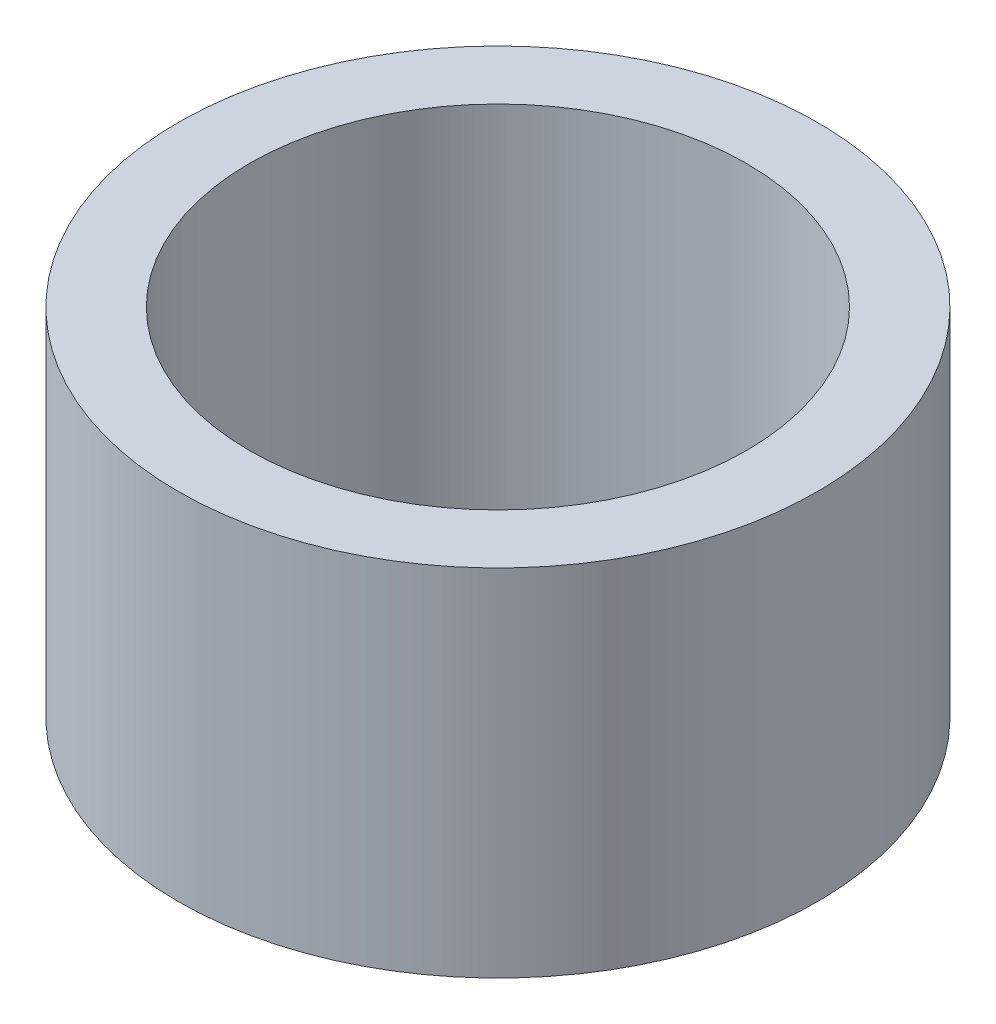
ISO-10303-21;
HEADER;
FILE_DESCRIPTION(('STEP AP214'),'2;1');
FILE_NAME('part.step','',(''),(''),'','','');
FILE_SCHEMA(('AUTOMOTIVE_DESIGN { 1 0 10303 214 1 1 1 1 }'));
ENDSEC;
DATA;
#1=APPLICATION_CONTEXT('core data for automotive mechanical design processes');
#2=APPLICATION_PROTOCOL_DEFINITION('international standard','automotive_design',2000,#1);
#3=PRODUCT_CONTEXT('',#1,'mechanical');
#4=PRODUCT('Part','Part','',(#3));
#5=PRODUCT_RELATED_PRODUCT_CATEGORY('part','',(#4));
#6=PRODUCT_DEFINITION_FORMATION('','',#4);
#7=PRODUCT_DEFINITION_CONTEXT('part definition',#1,'design');
#8=PRODUCT_DEFINITION('design','',#6,#7);
#9=PRODUCT_DEFINITION_SHAPE('','',#8);
#10=(LENGTH_UNIT() NAMED_UNIT(*) SI_UNIT(.MILLI.,.METRE.));
#11=(NAMED_UNIT(*) PLANE_ANGLE_UNIT() SI_UNIT($,.RADIAN.));
#12=(NAMED_UNIT(*) SI_UNIT($,.STERADIAN.) SOLID_ANGLE_UNIT());
#13=UNCERTAINTY_MEASURE_WITH_UNIT(LENGTH_MEASURE(1.E-05),#10,'distance_accuracy_value','');
#14=(GEOMETRIC_REPRESENTATION_CONTEXT(3) GLOBAL_UNCERTAINTY_ASSIGNED_CONTEXT((#13)) GLOBAL_UNIT_ASSIGNED_CONTEXT((#10,
#11,#12)) REPRESENTATION_CONTEXT('',''));
#15=CARTESIAN_POINT('',(0.,0.,0.));
#16=DIRECTION('',(0.,0.,1.));
#17=DIRECTION('',(1.,0.,0.));
#18=AXIS2_PLACEMENT_3D('',#15,#16,#17);
#19=CARTESIAN_POINT('',(0.,50.,0.));
#20=DIRECTION('',(0.,1.,0.));
#21=DIRECTION('',(0.,0.,1.));
#22=AXIS2_PLACEMENT_3D('',#19,#20,#21);
#23=PLANE('',#22);
#24=CARTESIAN_POINT('',(0.,50.,0.));
#25=DIRECTION('',(0.,1.,0.));
#26=DIRECTION('',(0.,0.,1.));
#27=AXIS2_PLACEMENT_3D('',#24,#25,#26);
#28=CIRCLE('',#27,45.);
#29=CARTESIAN_POINT('',(0.,50.,45.));
#30=VERTEX_POINT('',#29);
#31=EDGE_CURVE('E12',#30,#30,#28,.T.);
#32=ORIENTED_EDGE('',*,*,#31,.T.);
#33=EDGE_LOOP('',(#32));
#34=FACE_BOUND('',#33,.T.);
#35=CARTESIAN_POINT('',(0.,50.,0.));
#36=DIRECTION('',(0.,1.,0.));
#37=DIRECTION('',(0.,0.,1.));
#38=AXIS2_PLACEMENT_3D('',#35,#36,#37);
#39=CIRCLE('',#38,35.);
#40=CARTESIAN_POINT('',(0.,50.,35.));
#41=VERTEX_POINT('',#40);
#42=EDGE_CURVE('E55',#41,#41,#39,.T.);
#43=ORIENTED_EDGE('',*,*,#42,.F.);
#44=EDGE_LOOP('',(#43));
#45=FACE_BOUND('',#44,.T.);
#46=ADVANCED_FACE('F44',(#34,#45),#23,.T.);
#47=CARTESIAN_POINT('',(0.,0.,0.));
#48=DIRECTION('',(0.,1.,0.));
#49=DIRECTION('',(0.,0.,1.));
#50=AXIS2_PLACEMENT_3D('',#47,#48,#49);
#51=PLANE('',#50);
#52=CARTESIAN_POINT('',(0.,0.,0.));
#53=DIRECTION('',(0.,1.,0.));
#54=DIRECTION('',(0.,0.,1.));
#55=AXIS2_PLACEMENT_3D('',#52,#53,#54);
#56=CIRCLE('',#55,45.);
#57=CARTESIAN_POINT('',(0.,0.,45.));
#58=VERTEX_POINT('',#57);
#59=EDGE_CURVE('E48',#58,#58,#56,.T.);
#60=ORIENTED_EDGE('',*,*,#59,.F.);
#61=EDGE_LOOP('',(#60));
#62=FACE_BOUND('',#61,.T.);
#63=CARTESIAN_POINT('',(0.,0.,0.));
#64=DIRECTION('',(0.,1.,0.));
#65=DIRECTION('',(0.,0.,1.));
#66=AXIS2_PLACEMENT_3D('',#63,#64,#65);
#67=CIRCLE('',#66,35.);
#68=CARTESIAN_POINT('',(0.,0.,35.));
#69=VERTEX_POINT('',#68);
#70=EDGE_CURVE('E57',#69,#69,#67,.T.);
#71=ORIENTED_EDGE('',*,*,#70,.T.);
#72=EDGE_LOOP('',(#71));
#73=FACE_BOUND('',#72,.T.);
#74=ADVANCED_FACE('F67',(#62,#73),#51,.F.);
#75=CARTESIAN_POINT('',(0.,50.,0.));
#76=DIRECTION('',(0.,-1.,0.));
#77=DIRECTION('',(0.,0.,-1.));
#78=AXIS2_PLACEMENT_3D('',#75,#76,#77);
#79=CYLINDRICAL_SURFACE('',#78,45.);
#80=ORIENTED_EDGE('',*,*,#31,.F.);
#81=EDGE_LOOP('',(#80));
#82=FACE_BOUND('',#81,.T.);
#83=ORIENTED_EDGE('',*,*,#59,.T.);
#84=EDGE_LOOP('',(#83));
#85=FACE_BOUND('',#84,.T.);
#86=ADVANCED_FACE('F46',(#82,#85),#79,.T.);
#87=CARTESIAN_POINT('',(0.,50.,0.));
#88=DIRECTION('',(0.,-1.,0.));
#89=DIRECTION('',(0.,0.,-1.));
#90=AXIS2_PLACEMENT_3D('',#87,#88,#89);
#91=CYLINDRICAL_SURFACE('',#90,35.);
#92=ORIENTED_EDGE('',*,*,#42,.T.);
#93=EDGE_LOOP('',(#92));
#94=FACE_BOUND('',#93,.T.);
#95=ORIENTED_EDGE('',*,*,#70,.F.);
#96=EDGE_LOOP('',(#95));
#97=FACE_BOUND('',#96,.T.);
#98=ADVANCED_FACE('F63',(#94,#97),#91,.F.);
#99=CLOSED_SHELL('',(#46,#74,#86,#98));
#100=MANIFOLD_SOLID_BREP('B2',#99);
#101=ADVANCED_BREP_SHAPE_REPRESENTATION('',(#18,#100),#14);
#102=SHAPE_DEFINITION_REPRESENTATION(#9,#101);
ENDSEC;
END-ISO-10303-21;
